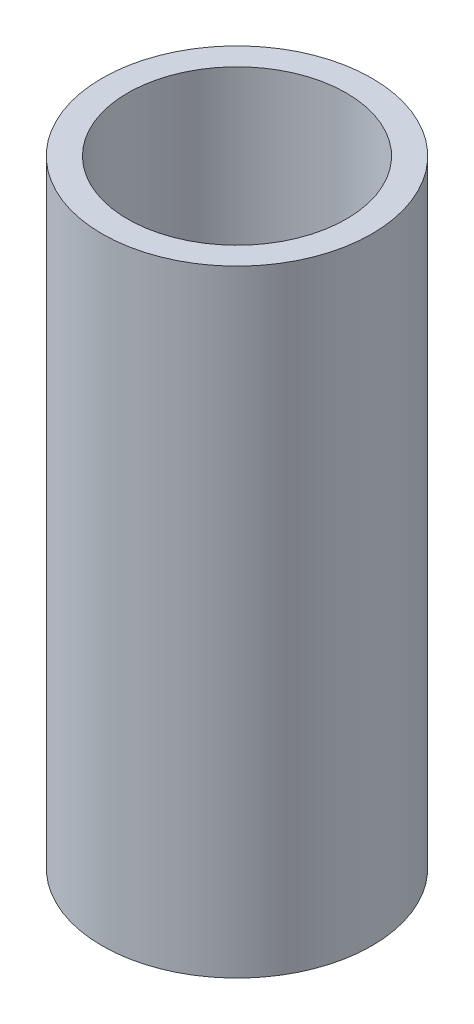
ISO-10303-21;
HEADER;
FILE_DESCRIPTION(('STEP AP214'),'2;1');
FILE_NAME('part.step','',(''),(''),'','','');
FILE_SCHEMA(('AUTOMOTIVE_DESIGN { 1 0 10303 214 1 1 1 1 }'));
ENDSEC;
DATA;
#1=APPLICATION_CONTEXT('core data for automotive mechanical design processes');
#2=APPLICATION_PROTOCOL_DEFINITION('international standard','automotive_design',2000,#1);
#3=PRODUCT_CONTEXT('',#1,'mechanical');
#4=PRODUCT('Part','Part','',(#3));
#5=PRODUCT_RELATED_PRODUCT_CATEGORY('part','',(#4));
#6=PRODUCT_DEFINITION_FORMATION('','',#4);
#7=PRODUCT_DEFINITION_CONTEXT('part definition',#1,'design');
#8=PRODUCT_DEFINITION('design','',#6,#7);
#9=PRODUCT_DEFINITION_SHAPE('','',#8);
#10=(LENGTH_UNIT() NAMED_UNIT(*) SI_UNIT(.MILLI.,.METRE.));
#11=(NAMED_UNIT(*) PLANE_ANGLE_UNIT() SI_UNIT($,.RADIAN.));
#12=(NAMED_UNIT(*) SI_UNIT($,.STERADIAN.) SOLID_ANGLE_UNIT());
#13=UNCERTAINTY_MEASURE_WITH_UNIT(LENGTH_MEASURE(1.E-05),#10,'distance_accuracy_value','');
#14=(GEOMETRIC_REPRESENTATION_CONTEXT(3) GLOBAL_UNCERTAINTY_ASSIGNED_CONTEXT((#13)) GLOBAL_UNIT_ASSIGNED_CONTEXT((#10,
#11,#12)) REPRESENTATION_CONTEXT('',''));
#15=CARTESIAN_POINT('',(0.,0.,0.));
#16=DIRECTION('',(0.,0.,1.));
#17=DIRECTION('',(1.,0.,0.));
#18=AXIS2_PLACEMENT_3D('',#15,#16,#17);
#19=CARTESIAN_POINT('',(0.,114.271054171842,0.));
#20=DIRECTION('',(0.,-1.,0.));
#21=DIRECTION('',(0.,0.,-1.));
#22=AXIS2_PLACEMENT_3D('',#19,#20,#21);
#23=CYLINDRICAL_SURFACE('',#22,25.);
#24=CARTESIAN_POINT('',(0.,114.271054171842,0.));
#25=DIRECTION('',(0.,1.,0.));
#26=DIRECTION('',(0.,0.,1.));
#27=AXIS2_PLACEMENT_3D('',#24,#25,#26);
#28=CIRCLE('',#27,25.);
#29=CARTESIAN_POINT('',(0.,114.271054171842,-25.));
#30=VERTEX_POINT('',#29);
#31=EDGE_CURVE('E10',#30,#30,#28,.T.);
#32=CARTESIAN_POINT('',(0.,0.,0.));
#33=DIRECTION('',(0.,1.,0.));
#34=DIRECTION('',(0.,0.,1.));
#35=AXIS2_PLACEMENT_3D('',#32,#33,#34);
#36=CIRCLE('',#35,25.);
#37=CARTESIAN_POINT('',(0.,0.,-25.));
#38=VERTEX_POINT('',#37);
#39=EDGE_CURVE('E37',#38,#38,#36,.T.);
#40=CARTESIAN_POINT('',(0.,114.271054171842,-25.));
#41=CARTESIAN_POINT('',(0.,113.080730690885,-25.));
#42=CARTESIAN_POINT('',(0.,111.890407209928,-25.));
#43=CARTESIAN_POINT('',(0.,109.509760248015,-25.));
#44=CARTESIAN_POINT('',(0.,108.319436767058,-25.));
#45=CARTESIAN_POINT('',(0.,105.938789805145,-25.));
#46=CARTESIAN_POINT('',(0.,104.748466324188,-25.));
#47=CARTESIAN_POINT('',(0.,102.367819362275,-25.));
#48=CARTESIAN_POINT('',(0.,101.177495881318,-25.));
#49=CARTESIAN_POINT('',(0.,98.796848919405,-25.));
#50=CARTESIAN_POINT('',(0.,97.6065254384483,-25.));
#51=CARTESIAN_POINT('',(0.,95.2258784765349,-25.));
#52=CARTESIAN_POINT('',(0.,94.0355549955782,-25.));
#53=CARTESIAN_POINT('',(0.,91.6549080336648,-25.));
#54=CARTESIAN_POINT('',(0.,90.4645845527081,-25.));
#55=CARTESIAN_POINT('',(0.,88.0839375907948,-25.));
#56=CARTESIAN_POINT('',(0.,86.8936141098381,-25.));
#57=CARTESIAN_POINT('',(0.,84.5129671479247,-25.));
#58=CARTESIAN_POINT('',(0.,83.322643666968,-25.));
#59=CARTESIAN_POINT('',(0.,80.9419967050547,-25.));
#60=CARTESIAN_POINT('',(0.,79.751673224098,-25.));
#61=CARTESIAN_POINT('',(0.,77.3710262621846,-25.));
#62=CARTESIAN_POINT('',(0.,76.1807027812279,-25.));
#63=CARTESIAN_POINT('',(0.,73.8000558193145,-25.));
#64=CARTESIAN_POINT('',(0.,72.6097323383579,-25.));
#65=CARTESIAN_POINT('',(0.,70.2290853764445,-25.));
#66=CARTESIAN_POINT('',(0.,69.0387618954878,-25.));
#67=CARTESIAN_POINT('',(0.,66.6581149335744,-25.));
#68=CARTESIAN_POINT('',(0.,65.4677914526177,-25.));
#69=CARTESIAN_POINT('',(0.,63.0871444907044,-25.));
#70=CARTESIAN_POINT('',(0.,61.8968210097477,-25.));
#71=CARTESIAN_POINT('',(0.,59.5161740478343,-25.));
#72=CARTESIAN_POINT('',(0.,58.3258505668776,-25.));
#73=CARTESIAN_POINT('',(0.,55.9452036049642,-25.));
#74=CARTESIAN_POINT('',(0.,54.7548801240076,-25.));
#75=CARTESIAN_POINT('',(0.,52.3742331620942,-25.));
#76=CARTESIAN_POINT('',(0.,51.1839096811375,-25.));
#77=CARTESIAN_POINT('',(0.,48.8032627192241,-25.));
#78=CARTESIAN_POINT('',(0.,47.6129392382674,-25.));
#79=CARTESIAN_POINT('',(0.,45.2322922763541,-25.));
#80=CARTESIAN_POINT('',(0.,44.0419687953974,-25.));
#81=CARTESIAN_POINT('',(0.,41.661321833484,-25.));
#82=CARTESIAN_POINT('',(0.,40.4709983525273,-25.));
#83=CARTESIAN_POINT('',(0.,38.090351390614,-25.));
#84=CARTESIAN_POINT('',(0.,36.9000279096573,-25.));
#85=CARTESIAN_POINT('',(0.,34.5193809477439,-25.));
#86=CARTESIAN_POINT('',(0.,33.3290574667872,-25.));
#87=CARTESIAN_POINT('',(0.,30.9484105048738,-25.));
#88=CARTESIAN_POINT('',(0.,29.7580870239172,-25.));
#89=CARTESIAN_POINT('',(0.,27.3774400620038,-25.));
#90=CARTESIAN_POINT('',(0.,26.1871165810471,-25.));
#91=CARTESIAN_POINT('',(0.,23.8064696191337,-25.));
#92=CARTESIAN_POINT('',(0.,22.616146138177,-25.));
#93=CARTESIAN_POINT('',(0.,20.2354991762637,-25.));
#94=CARTESIAN_POINT('',(0.,19.045175695307,-25.));
#95=CARTESIAN_POINT('',(0.,16.6645287333936,-25.));
#96=CARTESIAN_POINT('',(0.,15.4742052524369,-25.));
#97=CARTESIAN_POINT('',(0.,13.0935582905236,-25.));
#98=CARTESIAN_POINT('',(0.,11.9032348095669,-25.));
#99=CARTESIAN_POINT('',(0.,9.52258784765349,-25.));
#100=CARTESIAN_POINT('',(0.,8.3322643666968,-25.));
#101=CARTESIAN_POINT('',(0.,5.95161740478343,-25.));
#102=CARTESIAN_POINT('',(0.,4.76129392382674,-25.));
#103=CARTESIAN_POINT('',(0.,2.38064696191337,-25.));
#104=CARTESIAN_POINT('',(0.,1.19032348095668,-25.));
#105=CARTESIAN_POINT('',(0.,0.,-25.));
#106=B_SPLINE_CURVE_WITH_KNOTS('',3,(#40,#41,#42,#43,#44,#45,#46,#47,#48,#49,#50,#51,#52,#53,
#54,#55,#56,#57,#58,#59,#60,#61,#62,#63,#64,#65,#66,#67,#68,#69,#70,#71,#72,#73,#74,#75,#76,#77,
#78,#79,#80,#81,#82,#83,#84,#85,#86,#87,#88,#89,#90,#91,#92,#93,#94,#95,#96,#97,#98,#99,#100,
#101,#102,#103,#104,#105),.UNSPECIFIED.,.F.,.F.,(4,2,2,2,2,2,2,2,2,2,2,2,2,2,2,2,2,2,2,2,2,2,2,
2,2,2,2,2,2,2,2,2,4),(0.,3.57097044287005,7.14194088574011,10.7129113286102,14.2838817714802,
17.8548522143503,21.4258226572203,24.9967931000904,28.5677635429604,32.1387339858305,
35.7097044287006,39.2806748715706,42.8516453144407,46.4226157573107,49.9935862001808,
53.5645566430509,57.1355270859209,60.706497528791,64.277467971661,67.8484384145311,
71.4194088574012,74.9903793002712,78.5613497431413,82.1323201860113,85.7032906288814,
89.2742610717514,92.8452315146215,96.4162019574916,99.9871724003616,103.558142843232,
107.129113286102,110.700083728972,114.271054171842),.UNSPECIFIED.);
#107=EDGE_CURVE('BSEAM40',#30,#38,#106,.T.);
#108=ORIENTED_EDGE('',*,*,#31,.F.);
#109=ORIENTED_EDGE('',*,*,#39,.T.);
#110=ORIENTED_EDGE('',*,*,#107,.T.);
#111=ORIENTED_EDGE('',*,*,#107,.F.);
#112=EDGE_LOOP('',(#108,#110,#109,#111));
#113=FACE_BOUND('',#112,.T.);
#114=ADVANCED_FACE('F40',(#113),#23,.T.);
#115=CARTESIAN_POINT('',(0.,114.271054171842,0.));
#116=DIRECTION('',(0.,1.,0.));
#117=DIRECTION('',(0.,0.,1.));
#118=AXIS2_PLACEMENT_3D('',#115,#116,#117);
#119=PLANE('',#118);
#120=CARTESIAN_POINT('',(0.,114.271054171842,0.));
#121=DIRECTION('',(0.,1.,0.));
#122=DIRECTION('',(0.,0.,1.));
#123=AXIS2_PLACEMENT_3D('',#120,#121,#122);
#124=CIRCLE('',#123,20.2577883226176);
#125=CARTESIAN_POINT('',(0.,114.271054171842,-20.2577883226176));
#126=VERTEX_POINT('',#125);
#127=EDGE_CURVE('E50',#126,#126,#124,.T.);
#128=ORIENTED_EDGE('',*,*,#127,.F.);
#129=EDGE_LOOP('',(#128));
#130=FACE_BOUND('',#129,.T.);
#131=ORIENTED_EDGE('',*,*,#31,.T.);
#132=EDGE_LOOP('',(#131));
#133=FACE_BOUND('',#132,.T.);
#134=ADVANCED_FACE('F59',(#130,#133),#119,.T.);
#135=CARTESIAN_POINT('',(0.,0.,0.));
#136=DIRECTION('',(0.,1.,0.));
#137=DIRECTION('',(0.,0.,1.));
#138=AXIS2_PLACEMENT_3D('',#135,#136,#137);
#139=PLANE('',#138);
#140=CARTESIAN_POINT('',(0.,0.,0.));
#141=DIRECTION('',(0.,1.,0.));
#142=DIRECTION('',(0.,0.,1.));
#143=AXIS2_PLACEMENT_3D('',#140,#141,#142);
#144=CIRCLE('',#143,20.2577883226176);
#145=CARTESIAN_POINT('',(0.,0.,-20.2577883226176));
#146=VERTEX_POINT('',#145);
#147=EDGE_CURVE('E47',#146,#146,#144,.T.);
#148=ORIENTED_EDGE('',*,*,#147,.T.);
#149=EDGE_LOOP('',(#148));
#150=FACE_BOUND('',#149,.T.);
#151=ORIENTED_EDGE('',*,*,#39,.F.);
#152=EDGE_LOOP('',(#151));
#153=FACE_BOUND('',#152,.T.);
#154=ADVANCED_FACE('F58',(#150,#153),#139,.F.);
#155=CARTESIAN_POINT('',(0.,114.271054171842,0.));
#156=DIRECTION('',(0.,-1.,0.));
#157=DIRECTION('',(0.,0.,-1.));
#158=AXIS2_PLACEMENT_3D('',#155,#156,#157);
#159=CYLINDRICAL_SURFACE('',#158,20.2577883226176);
#160=CARTESIAN_POINT('',(0.,114.271054171842,-20.2577883226176));
#161=CARTESIAN_POINT('',(0.,113.080730690885,-20.2577883226176));
#162=CARTESIAN_POINT('',(0.,111.890407209928,-20.2577883226176));
#163=CARTESIAN_POINT('',(0.,109.509760248015,-20.2577883226176));
#164=CARTESIAN_POINT('',(0.,108.319436767058,-20.2577883226176));
#165=CARTESIAN_POINT('',(0.,105.938789805145,-20.2577883226176));
#166=CARTESIAN_POINT('',(0.,104.748466324188,-20.2577883226176));
#167=CARTESIAN_POINT('',(0.,102.367819362275,-20.2577883226176));
#168=CARTESIAN_POINT('',(0.,101.177495881318,-20.2577883226176));
#169=CARTESIAN_POINT('',(0.,98.796848919405,-20.2577883226176));
#170=CARTESIAN_POINT('',(0.,97.6065254384482,-20.2577883226176));
#171=CARTESIAN_POINT('',(0.,95.2258784765349,-20.2577883226176));
#172=CARTESIAN_POINT('',(0.,94.0355549955782,-20.2577883226176));
#173=CARTESIAN_POINT('',(0.,91.6549080336648,-20.2577883226176));
#174=CARTESIAN_POINT('',(0.,90.4645845527081,-20.2577883226176));
#175=CARTESIAN_POINT('',(0.,88.0839375907948,-20.2577883226176));
#176=CARTESIAN_POINT('',(0.,86.8936141098381,-20.2577883226176));
#177=CARTESIAN_POINT('',(0.,84.5129671479247,-20.2577883226176));
#178=CARTESIAN_POINT('',(0.,83.322643666968,-20.2577883226176));
#179=CARTESIAN_POINT('',(0.,80.9419967050546,-20.2577883226176));
#180=CARTESIAN_POINT('',(0.,79.751673224098,-20.2577883226176));
#181=CARTESIAN_POINT('',(0.,77.3710262621846,-20.2577883226176));
#182=CARTESIAN_POINT('',(0.,76.1807027812279,-20.2577883226176));
#183=CARTESIAN_POINT('',(0.,73.8000558193145,-20.2577883226176));
#184=CARTESIAN_POINT('',(0.,72.6097323383579,-20.2577883226176));
#185=CARTESIAN_POINT('',(0.,70.2290853764445,-20.2577883226176));
#186=CARTESIAN_POINT('',(0.,69.0387618954878,-20.2577883226176));
#187=CARTESIAN_POINT('',(0.,66.6581149335744,-20.2577883226176));
#188=CARTESIAN_POINT('',(0.,65.4677914526177,-20.2577883226176));
#189=CARTESIAN_POINT('',(0.,63.0871444907044,-20.2577883226176));
#190=CARTESIAN_POINT('',(0.,61.8968210097477,-20.2577883226176));
#191=CARTESIAN_POINT('',(0.,59.5161740478343,-20.2577883226176));
#192=CARTESIAN_POINT('',(0.,58.3258505668776,-20.2577883226176));
#193=CARTESIAN_POINT('',(0.,55.9452036049642,-20.2577883226176));
#194=CARTESIAN_POINT('',(0.,54.7548801240076,-20.2577883226176));
#195=CARTESIAN_POINT('',(0.,52.3742331620942,-20.2577883226176));
#196=CARTESIAN_POINT('',(0.,51.1839096811375,-20.2577883226176));
#197=CARTESIAN_POINT('',(0.,48.8032627192241,-20.2577883226176));
#198=CARTESIAN_POINT('',(0.,47.6129392382675,-20.2577883226176));
#199=CARTESIAN_POINT('',(0.,45.2322922763541,-20.2577883226176));
#200=CARTESIAN_POINT('',(0.,44.0419687953974,-20.2577883226176));
#201=CARTESIAN_POINT('',(0.,41.661321833484,-20.2577883226176));
#202=CARTESIAN_POINT('',(0.,40.4709983525273,-20.2577883226176));
#203=CARTESIAN_POINT('',(0.,38.090351390614,-20.2577883226176));
#204=CARTESIAN_POINT('',(0.,36.9000279096573,-20.2577883226176));
#205=CARTESIAN_POINT('',(0.,34.5193809477439,-20.2577883226176));
#206=CARTESIAN_POINT('',(0.,33.3290574667872,-20.2577883226176));
#207=CARTESIAN_POINT('',(0.,30.9484105048738,-20.2577883226176));
#208=CARTESIAN_POINT('',(0.,29.7580870239172,-20.2577883226176));
#209=CARTESIAN_POINT('',(0.,27.3774400620038,-20.2577883226176));
#210=CARTESIAN_POINT('',(0.,26.1871165810471,-20.2577883226176));
#211=CARTESIAN_POINT('',(0.,23.8064696191337,-20.2577883226176));
#212=CARTESIAN_POINT('',(0.,22.616146138177,-20.2577883226176));
#213=CARTESIAN_POINT('',(0.,20.2354991762637,-20.2577883226176));
#214=CARTESIAN_POINT('',(0.,19.045175695307,-20.2577883226176));
#215=CARTESIAN_POINT('',(0.,16.6645287333936,-20.2577883226176));
#216=CARTESIAN_POINT('',(0.,15.4742052524369,-20.2577883226176));
#217=CARTESIAN_POINT('',(0.,13.0935582905236,-20.2577883226176));
#218=CARTESIAN_POINT('',(0.,11.9032348095669,-20.2577883226176));
#219=CARTESIAN_POINT('',(0.,9.52258784765349,-20.2577883226176));
#220=CARTESIAN_POINT('',(0.,8.3322643666968,-20.2577883226176));
#221=CARTESIAN_POINT('',(0.,5.95161740478343,-20.2577883226176));
#222=CARTESIAN_POINT('',(0.,4.76129392382674,-20.2577883226176));
#223=CARTESIAN_POINT('',(0.,2.38064696191337,-20.2577883226176));
#224=CARTESIAN_POINT('',(0.,1.19032348095668,-20.2577883226176));
#225=CARTESIAN_POINT('',(0.,0.,-20.2577883226176));
#226=B_SPLINE_CURVE_WITH_KNOTS('',3,(#160,#161,#162,#163,#164,#165,#166,#167,#168,#169,#170,
#171,#172,#173,#174,#175,#176,#177,#178,#179,#180,#181,#182,#183,#184,#185,#186,#187,#188,#189,
#190,#191,#192,#193,#194,#195,#196,#197,#198,#199,#200,#201,#202,#203,#204,#205,#206,#207,#208,
#209,#210,#211,#212,#213,#214,#215,#216,#217,#218,#219,#220,#221,#222,#223,#224,#225),
.UNSPECIFIED.,.F.,.F.,(4,2,2,2,2,2,2,2,2,2,2,2,2,2,2,2,2,2,2,2,2,2,2,2,2,2,2,2,2,2,2,2,4),(0.,
3.57097044287007,7.14194088574012,10.7129113286102,14.2838817714802,17.8548522143503,
21.4258226572204,24.9967931000904,28.5677635429605,32.1387339858305,35.7097044287006,
39.2806748715707,42.8516453144407,46.4226157573108,49.9935862001808,53.5645566430509,
57.1355270859209,60.706497528791,64.2774679716611,67.8484384145311,71.4194088574012,
74.9903793002712,78.5613497431413,82.1323201860113,85.7032906288814,89.2742610717515,
92.8452315146215,96.4162019574916,99.9871724003616,103.558142843232,107.129113286102,
110.700083728972,114.271054171842),.UNSPECIFIED.);
#227=EDGE_CURVE('BSEAM54',#126,#146,#226,.T.);
#228=ORIENTED_EDGE('',*,*,#127,.T.);
#229=ORIENTED_EDGE('',*,*,#147,.F.);
#230=ORIENTED_EDGE('',*,*,#227,.T.);
#231=ORIENTED_EDGE('',*,*,#227,.F.);
#232=EDGE_LOOP('',(#228,#230,#229,#231));
#233=FACE_BOUND('',#232,.T.);
#234=ADVANCED_FACE('F54',(#233),#159,.F.);
#235=CLOSED_SHELL('',(#114,#134,#154,#234));
#236=MANIFOLD_SOLID_BREP('B2',#235);
#237=ADVANCED_BREP_SHAPE_REPRESENTATION('',(#18,#236),#14);
#238=SHAPE_DEFINITION_REPRESENTATION(#9,#237);
ENDSEC;
END-ISO-10303-21;
